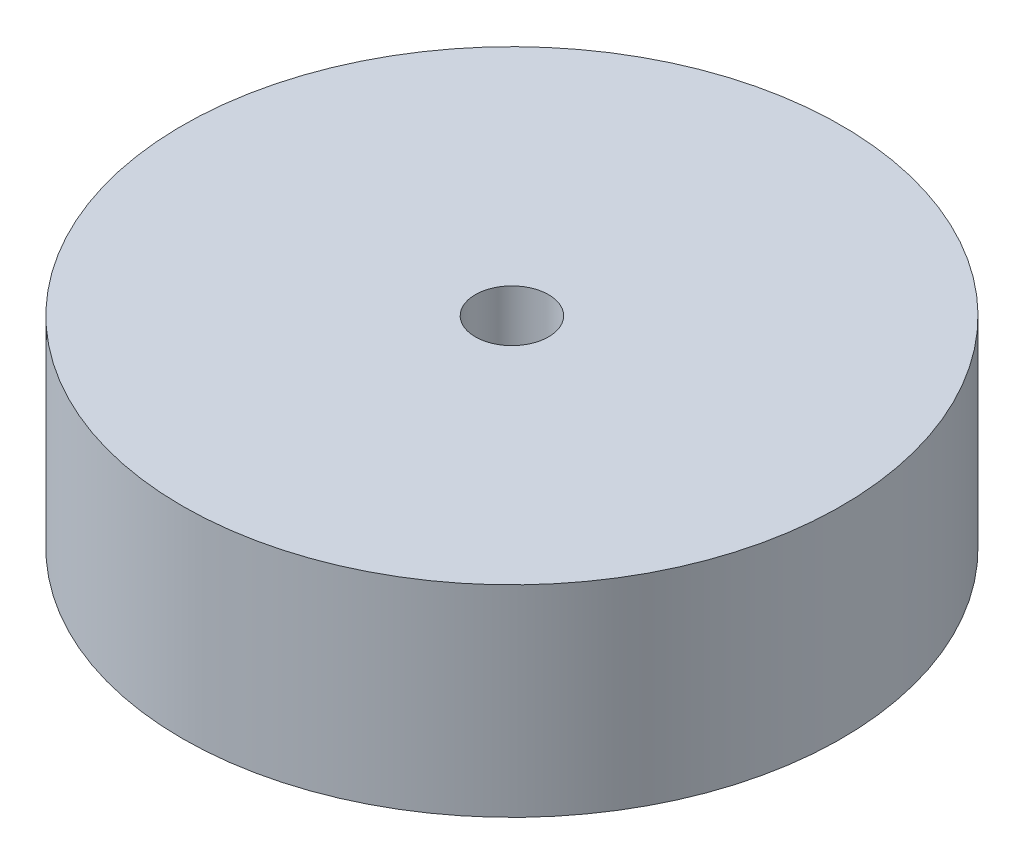
ISO-10303-21;
HEADER;
FILE_DESCRIPTION(('STEP AP214'),'2;1');
FILE_NAME('part.step','',(''),(''),'','','');
FILE_SCHEMA(('AUTOMOTIVE_DESIGN { 1 0 10303 214 1 1 1 1 }'));
ENDSEC;
DATA;
#1=APPLICATION_CONTEXT('core data for automotive mechanical design processes');
#2=APPLICATION_PROTOCOL_DEFINITION('international standard','automotive_design',2000,#1);
#3=PRODUCT_CONTEXT('',#1,'mechanical');
#4=PRODUCT('Part','Part','',(#3));
#5=PRODUCT_RELATED_PRODUCT_CATEGORY('part','',(#4));
#6=PRODUCT_DEFINITION_FORMATION('','',#4);
#7=PRODUCT_DEFINITION_CONTEXT('part definition',#1,'design');
#8=PRODUCT_DEFINITION('design','',#6,#7);
#9=PRODUCT_DEFINITION_SHAPE('','',#8);
#10=(LENGTH_UNIT() NAMED_UNIT(*) SI_UNIT(.MILLI.,.METRE.));
#11=(NAMED_UNIT(*) PLANE_ANGLE_UNIT() SI_UNIT($,.RADIAN.));
#12=(NAMED_UNIT(*) SI_UNIT($,.STERADIAN.) SOLID_ANGLE_UNIT());
#13=UNCERTAINTY_MEASURE_WITH_UNIT(LENGTH_MEASURE(1.E-05),#10,'distance_accuracy_value','');
#14=(GEOMETRIC_REPRESENTATION_CONTEXT(3) GLOBAL_UNCERTAINTY_ASSIGNED_CONTEXT((#13)) GLOBAL_UNIT_ASSIGNED_CONTEXT((#10,
#11,#12)) REPRESENTATION_CONTEXT('',''));
#15=CARTESIAN_POINT('',(0.,0.,0.));
#16=DIRECTION('',(0.,0.,1.));
#17=DIRECTION('',(1.,0.,0.));
#18=AXIS2_PLACEMENT_3D('',#15,#16,#17);
#19=CARTESIAN_POINT('',(0.,0.,0.));
#20=DIRECTION('',(0.,1.,0.));
#21=DIRECTION('',(0.,0.,1.));
#22=AXIS2_PLACEMENT_3D('',#19,#20,#21);
#23=PLANE('',#22);
#24=CARTESIAN_POINT('',(4.76313972081442,0.,2.75));
#25=DIRECTION('',(0.,1.,0.));
#26=DIRECTION('',(0.,0.,1.));
#27=AXIS2_PLACEMENT_3D('',#24,#25,#26);
#28=CIRCLE('',#27,2.);
#29=CARTESIAN_POINT('',(4.76313972081442,0.,4.75));
#30=VERTEX_POINT('',#29);
#31=EDGE_CURVE('E46',#30,#30,#28,.T.);
#32=ORIENTED_EDGE('',*,*,#31,.T.);
#33=EDGE_LOOP('',(#32));
#34=FACE_BOUND('',#33,.T.);
#35=CARTESIAN_POINT('',(-4.76313972081441,0.,2.75));
#36=DIRECTION('',(0.,1.,0.));
#37=DIRECTION('',(0.,0.,1.));
#38=AXIS2_PLACEMENT_3D('',#35,#36,#37);
#39=CIRCLE('',#38,2.);
#40=CARTESIAN_POINT('',(-4.76313972081441,0.,4.75));
#41=VERTEX_POINT('',#40);
#42=EDGE_CURVE('E38',#41,#41,#39,.T.);
#43=ORIENTED_EDGE('',*,*,#42,.T.);
#44=EDGE_LOOP('',(#43));
#45=FACE_BOUND('',#44,.T.);
#46=CARTESIAN_POINT('',(0.,0.,0.));
#47=DIRECTION('',(0.,1.,0.));
#48=DIRECTION('',(0.,0.,1.));
#49=AXIS2_PLACEMENT_3D('',#46,#47,#48);
#50=CIRCLE('',#49,9.);
#51=CARTESIAN_POINT('',(0.,0.,9.));
#52=VERTEX_POINT('',#51);
#53=EDGE_CURVE('E10',#52,#52,#50,.T.);
#54=ORIENTED_EDGE('',*,*,#53,.F.);
#55=EDGE_LOOP('',(#54));
#56=FACE_BOUND('',#55,.T.);
#57=CARTESIAN_POINT('',(0.,0.,-5.5));
#58=DIRECTION('',(0.,1.,0.));
#59=DIRECTION('',(0.,0.,1.));
#60=AXIS2_PLACEMENT_3D('',#57,#58,#59);
#61=CIRCLE('',#60,2.);
#62=CARTESIAN_POINT('',(0.,0.,-3.5));
#63=VERTEX_POINT('',#62);
#64=EDGE_CURVE('E42',#63,#63,#61,.T.);
#65=ORIENTED_EDGE('',*,*,#64,.T.);
#66=EDGE_LOOP('',(#65));
#67=FACE_BOUND('',#66,.T.);
#68=CARTESIAN_POINT('',(0.,0.,0.));
#69=DIRECTION('',(0.,1.,0.));
#70=DIRECTION('',(0.,0.,1.));
#71=AXIS2_PLACEMENT_3D('',#68,#69,#70);
#72=CIRCLE('',#71,2.25);
#73=CARTESIAN_POINT('',(0.,0.,2.25));
#74=VERTEX_POINT('',#73);
#75=EDGE_CURVE('E51',#74,#74,#72,.T.);
#76=ORIENTED_EDGE('',*,*,#75,.T.);
#77=EDGE_LOOP('',(#76));
#78=FACE_BOUND('',#77,.T.);
#79=ADVANCED_FACE('F31',(#34,#45,#56,#67,#78),#23,.F.);
#80=CARTESIAN_POINT('',(0.,2.5,0.));
#81=DIRECTION('',(0.,-1.,0.));
#82=DIRECTION('',(0.,0.,-1.));
#83=AXIS2_PLACEMENT_3D('',#80,#81,#82);
#84=CYLINDRICAL_SURFACE('',#83,9.);
#85=ORIENTED_EDGE('',*,*,#53,.T.);
#86=EDGE_LOOP('',(#85));
#87=FACE_BOUND('',#86,.T.);
#88=CARTESIAN_POINT('',(0.,5.5,0.));
#89=DIRECTION('',(0.,1.,0.));
#90=DIRECTION('',(0.,0.,1.));
#91=AXIS2_PLACEMENT_3D('',#88,#89,#90);
#92=CIRCLE('',#91,9.);
#93=CARTESIAN_POINT('',(0.,5.5,9.));
#94=VERTEX_POINT('',#93);
#95=EDGE_CURVE('E66',#94,#94,#92,.T.);
#96=ORIENTED_EDGE('',*,*,#95,.F.);
#97=EDGE_LOOP('',(#96));
#98=FACE_BOUND('',#97,.T.);
#99=ADVANCED_FACE('F33',(#87,#98),#84,.T.);
#100=CARTESIAN_POINT('',(-4.76313972081441,2.5,2.75));
#101=DIRECTION('',(0.,-1.,0.));
#102=DIRECTION('',(0.,0.,-1.));
#103=AXIS2_PLACEMENT_3D('',#100,#101,#102);
#104=CYLINDRICAL_SURFACE('',#103,2.);
#105=CARTESIAN_POINT('',(-4.76313972081441,2.5,2.75));
#106=DIRECTION('',(0.,1.,0.));
#107=DIRECTION('',(0.,0.,1.));
#108=AXIS2_PLACEMENT_3D('',#105,#106,#107);
#109=CIRCLE('',#108,2.);
#110=CARTESIAN_POINT('',(-4.76313972081441,2.5,4.75));
#111=VERTEX_POINT('',#110);
#112=EDGE_CURVE('E54',#111,#111,#109,.T.);
#113=ORIENTED_EDGE('',*,*,#112,.T.);
#114=EDGE_LOOP('',(#113));
#115=FACE_BOUND('',#114,.T.);
#116=ORIENTED_EDGE('',*,*,#42,.F.);
#117=EDGE_LOOP('',(#116));
#118=FACE_BOUND('',#117,.T.);
#119=ADVANCED_FACE('F87',(#115,#118),#104,.F.);
#120=CARTESIAN_POINT('',(0.,2.5,-5.5));
#121=DIRECTION('',(0.,-1.,0.));
#122=DIRECTION('',(0.,0.,-1.));
#123=AXIS2_PLACEMENT_3D('',#120,#121,#122);
#124=CYLINDRICAL_SURFACE('',#123,2.);
#125=CARTESIAN_POINT('',(0.,2.5,-5.5));
#126=DIRECTION('',(0.,1.,0.));
#127=DIRECTION('',(0.,0.,1.));
#128=AXIS2_PLACEMENT_3D('',#125,#126,#127);
#129=CIRCLE('',#128,2.);
#130=CARTESIAN_POINT('',(0.,2.5,-3.5));
#131=VERTEX_POINT('',#130);
#132=EDGE_CURVE('E57',#131,#131,#129,.T.);
#133=ORIENTED_EDGE('',*,*,#132,.T.);
#134=EDGE_LOOP('',(#133));
#135=FACE_BOUND('',#134,.T.);
#136=ORIENTED_EDGE('',*,*,#64,.F.);
#137=EDGE_LOOP('',(#136));
#138=FACE_BOUND('',#137,.T.);
#139=ADVANCED_FACE('F92',(#135,#138),#124,.F.);
#140=CARTESIAN_POINT('',(4.76313972081442,2.5,2.75));
#141=DIRECTION('',(0.,-1.,0.));
#142=DIRECTION('',(0.,0.,-1.));
#143=AXIS2_PLACEMENT_3D('',#140,#141,#142);
#144=CYLINDRICAL_SURFACE('',#143,2.);
#145=CARTESIAN_POINT('',(4.76313972081442,2.5,2.75));
#146=DIRECTION('',(0.,1.,0.));
#147=DIRECTION('',(0.,0.,1.));
#148=AXIS2_PLACEMENT_3D('',#145,#146,#147);
#149=CIRCLE('',#148,2.);
#150=CARTESIAN_POINT('',(4.76313972081442,2.5,4.75));
#151=VERTEX_POINT('',#150);
#152=EDGE_CURVE('E60',#151,#151,#149,.T.);
#153=ORIENTED_EDGE('',*,*,#152,.T.);
#154=EDGE_LOOP('',(#153));
#155=FACE_BOUND('',#154,.T.);
#156=ORIENTED_EDGE('',*,*,#31,.F.);
#157=EDGE_LOOP('',(#156));
#158=FACE_BOUND('',#157,.T.);
#159=ADVANCED_FACE('F101',(#155,#158),#144,.F.);
#160=CARTESIAN_POINT('',(0.,2.5,0.));
#161=DIRECTION('',(0.,-1.,0.));
#162=DIRECTION('',(0.,0.,-1.));
#163=AXIS2_PLACEMENT_3D('',#160,#161,#162);
#164=CYLINDRICAL_SURFACE('',#163,2.25);
#165=CARTESIAN_POINT('',(0.,2.5,0.));
#166=DIRECTION('',(0.,1.,0.));
#167=DIRECTION('',(0.,0.,1.));
#168=AXIS2_PLACEMENT_3D('',#165,#166,#167);
#169=CIRCLE('',#168,2.25);
#170=CARTESIAN_POINT('',(0.,2.5,2.25));
#171=VERTEX_POINT('',#170);
#172=EDGE_CURVE('E63',#171,#171,#169,.T.);
#173=ORIENTED_EDGE('',*,*,#172,.T.);
#174=EDGE_LOOP('',(#173));
#175=FACE_BOUND('',#174,.T.);
#176=ORIENTED_EDGE('',*,*,#75,.F.);
#177=EDGE_LOOP('',(#176));
#178=FACE_BOUND('',#177,.T.);
#179=ADVANCED_FACE('F105',(#175,#178),#164,.F.);
#180=CARTESIAN_POINT('',(0.,2.5,0.));
#181=DIRECTION('',(0.,1.,0.));
#182=DIRECTION('',(0.,0.,1.));
#183=AXIS2_PLACEMENT_3D('',#180,#181,#182);
#184=PLANE('',#183);
#185=CARTESIAN_POINT('',(0.,2.5,0.));
#186=DIRECTION('',(0.,1.,0.));
#187=DIRECTION('',(0.,0.,1.));
#188=AXIS2_PLACEMENT_3D('',#185,#186,#187);
#189=CIRCLE('',#188,1.);
#190=CARTESIAN_POINT('',(0.,2.5,1.));
#191=VERTEX_POINT('',#190);
#192=EDGE_CURVE('E69',#191,#191,#189,.T.);
#193=ORIENTED_EDGE('',*,*,#192,.T.);
#194=EDGE_LOOP('',(#193));
#195=FACE_BOUND('',#194,.T.);
#196=ORIENTED_EDGE('',*,*,#172,.F.);
#197=EDGE_LOOP('',(#196));
#198=FACE_BOUND('',#197,.T.);
#199=ADVANCED_FACE('F109',(#195,#198),#184,.F.);
#200=ORIENTED_EDGE('',*,*,#152,.F.);
#201=EDGE_LOOP('',(#200));
#202=FACE_BOUND('',#201,.T.);
#203=ADVANCED_FACE('F112',(#202),#184,.F.);
#204=ORIENTED_EDGE('',*,*,#132,.F.);
#205=EDGE_LOOP('',(#204));
#206=FACE_BOUND('',#205,.T.);
#207=ADVANCED_FACE('F129',(#206),#184,.F.);
#208=ORIENTED_EDGE('',*,*,#112,.F.);
#209=EDGE_LOOP('',(#208));
#210=FACE_BOUND('',#209,.T.);
#211=ADVANCED_FACE('F82',(#210),#184,.F.);
#212=CARTESIAN_POINT('',(0.,5.5,0.));
#213=DIRECTION('',(0.,1.,0.));
#214=DIRECTION('',(0.,0.,1.));
#215=AXIS2_PLACEMENT_3D('',#212,#213,#214);
#216=PLANE('',#215);
#217=CARTESIAN_POINT('',(0.,5.5,0.));
#218=DIRECTION('',(0.,1.,0.));
#219=DIRECTION('',(0.,0.,1.));
#220=AXIS2_PLACEMENT_3D('',#217,#218,#219);
#221=CIRCLE('',#220,1.);
#222=CARTESIAN_POINT('',(0.,5.5,1.));
#223=VERTEX_POINT('',#222);
#224=EDGE_CURVE('E72',#223,#223,#221,.T.);
#225=ORIENTED_EDGE('',*,*,#224,.F.);
#226=EDGE_LOOP('',(#225));
#227=FACE_BOUND('',#226,.T.);
#228=ORIENTED_EDGE('',*,*,#95,.T.);
#229=EDGE_LOOP('',(#228));
#230=FACE_BOUND('',#229,.T.);
#231=ADVANCED_FACE('F79',(#227,#230),#216,.T.);
#232=CARTESIAN_POINT('',(0.,0.,0.));
#233=DIRECTION('',(0.,1.,0.));
#234=DIRECTION('',(0.,0.,1.));
#235=AXIS2_PLACEMENT_3D('',#232,#233,#234);
#236=CYLINDRICAL_SURFACE('',#235,1.);
#237=ORIENTED_EDGE('',*,*,#224,.T.);
#238=EDGE_LOOP('',(#237));
#239=FACE_BOUND('',#238,.T.);
#240=ORIENTED_EDGE('',*,*,#192,.F.);
#241=EDGE_LOOP('',(#240));
#242=FACE_BOUND('',#241,.T.);
#243=ADVANCED_FACE('F76',(#239,#242),#236,.F.);
#244=CLOSED_SHELL('',(#79,#99,#119,#139,#159,#179,#199,#203,#207,#211,#231,#243));
#245=MANIFOLD_SOLID_BREP('B2',#244);
#246=ADVANCED_BREP_SHAPE_REPRESENTATION('',(#18,#245),#14);
#247=SHAPE_DEFINITION_REPRESENTATION(#9,#246);
ENDSEC;
END-ISO-10303-21;
